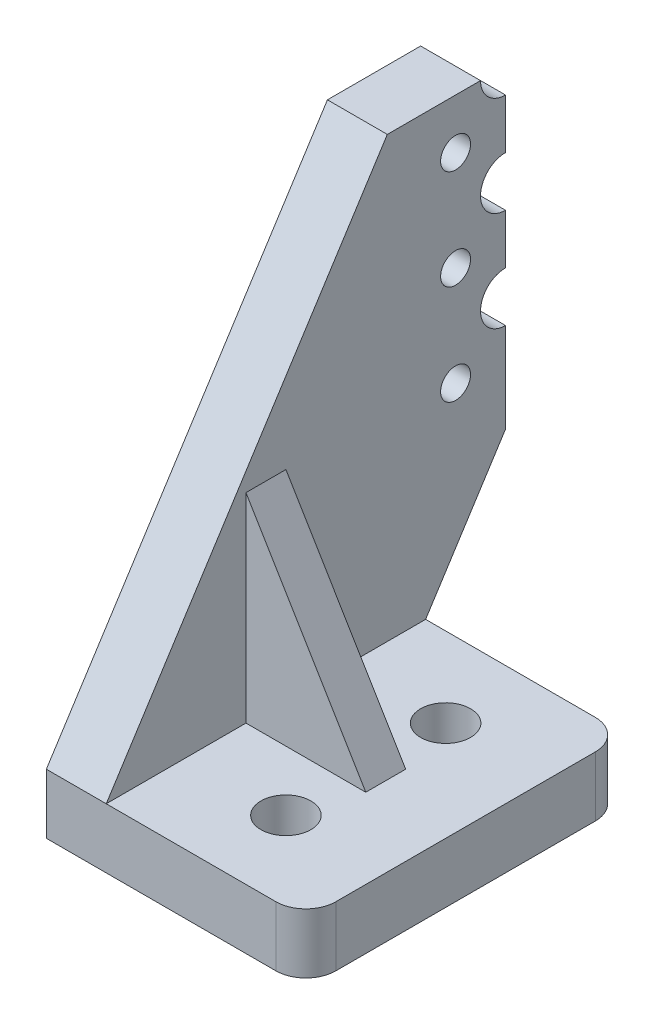
ISO-10303-21;
HEADER;
FILE_DESCRIPTION(('STEP AP214'),'2;1');
FILE_NAME('part.step','',(''),(''),'','','');
FILE_SCHEMA(('AUTOMOTIVE_DESIGN { 1 0 10303 214 1 1 1 1 }'));
ENDSEC;
DATA;
#1=APPLICATION_CONTEXT('core data for automotive mechanical design processes');
#2=APPLICATION_PROTOCOL_DEFINITION('international standard','automotive_design',2000,#1);
#3=PRODUCT_CONTEXT('',#1,'mechanical');
#4=PRODUCT('Part','Part','',(#3));
#5=PRODUCT_RELATED_PRODUCT_CATEGORY('part','',(#4));
#6=PRODUCT_DEFINITION_FORMATION('','',#4);
#7=PRODUCT_DEFINITION_CONTEXT('part definition',#1,'design');
#8=PRODUCT_DEFINITION('design','',#6,#7);
#9=PRODUCT_DEFINITION_SHAPE('','',#8);
#10=(LENGTH_UNIT() NAMED_UNIT(*) SI_UNIT(.MILLI.,.METRE.));
#11=(NAMED_UNIT(*) PLANE_ANGLE_UNIT() SI_UNIT($,.RADIAN.));
#12=(NAMED_UNIT(*) SI_UNIT($,.STERADIAN.) SOLID_ANGLE_UNIT());
#13=UNCERTAINTY_MEASURE_WITH_UNIT(LENGTH_MEASURE(1.E-05),#10,'distance_accuracy_value','');
#14=(GEOMETRIC_REPRESENTATION_CONTEXT(3) GLOBAL_UNCERTAINTY_ASSIGNED_CONTEXT((#13)) GLOBAL_UNIT_ASSIGNED_CONTEXT((#10,
#11,#12)) REPRESENTATION_CONTEXT('',''));
#15=CARTESIAN_POINT('',(0.,0.,0.));
#16=DIRECTION('',(0.,0.,1.));
#17=DIRECTION('',(1.,0.,0.));
#18=AXIS2_PLACEMENT_3D('',#15,#16,#17);
#19=CARTESIAN_POINT('',(3.,30.,0.));
#20=DIRECTION('',(-1.,0.,0.));
#21=DIRECTION('',(0.,0.,-1.));
#22=AXIS2_PLACEMENT_3D('',#19,#20,#21);
#23=PLANE('',#22);
#24=CARTESIAN_POINT('',(3.,17.5,2.5));
#25=DIRECTION('',(1.,0.,0.));
#26=DIRECTION('',(0.,0.,-1.));
#27=AXIS2_PLACEMENT_3D('',#24,#25,#26);
#28=CIRCLE('',#27,0.750000000000001);
#29=CARTESIAN_POINT('',(3.,17.5,1.75));
#30=VERTEX_POINT('',#29);
#31=EDGE_CURVE('E347',#30,#30,#28,.F.);
#32=ORIENTED_EDGE('',*,*,#31,.T.);
#33=EDGE_LOOP('',(#32));
#34=FACE_BOUND('',#33,.T.);
#35=CARTESIAN_POINT('',(3.,22.5,2.5));
#36=DIRECTION('',(1.,0.,0.));
#37=DIRECTION('',(0.,0.,-1.));
#38=AXIS2_PLACEMENT_3D('',#35,#36,#37);
#39=CIRCLE('',#38,0.750000000000001);
#40=CARTESIAN_POINT('',(3.,22.5,1.75));
#41=VERTEX_POINT('',#40);
#42=EDGE_CURVE('E341',#41,#41,#39,.F.);
#43=ORIENTED_EDGE('',*,*,#42,.T.);
#44=EDGE_LOOP('',(#43));
#45=FACE_BOUND('',#44,.T.);
#46=CARTESIAN_POINT('',(3.,12.5,2.5));
#47=DIRECTION('',(1.,0.,0.));
#48=DIRECTION('',(0.,0.,-1.));
#49=AXIS2_PLACEMENT_3D('',#46,#47,#48);
#50=CIRCLE('',#49,0.750000000000001);
#51=CARTESIAN_POINT('',(3.,12.5,1.75));
#52=VERTEX_POINT('',#51);
#53=EDGE_CURVE('E170',#52,#52,#50,.F.);
#54=ORIENTED_EDGE('',*,*,#53,.T.);
#55=EDGE_LOOP('',(#54));
#56=FACE_BOUND('',#55,.T.);
#57=CARTESIAN_POINT('',(3.,20.,0.));
#58=DIRECTION('',(1.,0.,0.));
#59=DIRECTION('',(0.,0.,-1.));
#60=AXIS2_PLACEMENT_3D('',#57,#58,#59);
#61=CIRCLE('',#60,1.25);
#62=CARTESIAN_POINT('',(3.,21.25,0.));
#63=VERTEX_POINT('',#62);
#64=CARTESIAN_POINT('',(3.,18.75,0.));
#65=VERTEX_POINT('',#64);
#66=EDGE_CURVE('E189',#63,#65,#61,.T.);
#67=ORIENTED_EDGE('',*,*,#66,.F.);
#68=DIRECTION('',(0.,1.,0.));
#69=VECTOR('',#68,1.);
#70=CARTESIAN_POINT('',(3.,0.,0.));
#71=LINE('',#70,#69);
#72=CARTESIAN_POINT('',(3.,23.75,0.));
#73=VERTEX_POINT('',#72);
#74=EDGE_CURVE('E185',#63,#73,#71,.T.);
#75=ORIENTED_EDGE('',*,*,#74,.T.);
#76=CARTESIAN_POINT('',(3.,25.,0.));
#77=DIRECTION('',(1.,0.,0.));
#78=DIRECTION('',(0.,0.,-1.));
#79=AXIS2_PLACEMENT_3D('',#76,#77,#78);
#80=CIRCLE('',#79,1.25);
#81=CARTESIAN_POINT('',(3.,25.,1.25));
#82=VERTEX_POINT('',#81);
#83=EDGE_CURVE('E163',#82,#73,#80,.T.);
#84=ORIENTED_EDGE('',*,*,#83,.F.);
#85=DIRECTION('',(0.,0.,1.));
#86=VECTOR('',#85,1.);
#87=CARTESIAN_POINT('',(3.,25.,0.));
#88=LINE('',#87,#86);
#89=CARTESIAN_POINT('',(3.,25.,5.92));
#90=VERTEX_POINT('',#89);
#91=EDGE_CURVE('E173',#82,#90,#88,.T.);
#92=ORIENTED_EDGE('',*,*,#91,.T.);
#93=DIRECTION('',(0.,-0.842271400661511,0.539053696423367));
#94=VECTOR('',#93,1.);
#95=CARTESIAN_POINT('',(3.,28.,4.));
#96=LINE('',#95,#94);
#97=CARTESIAN_POINT('',(3.,3.,20.));
#98=VERTEX_POINT('',#97);
#99=EDGE_CURVE('E213',#90,#98,#96,.T.);
#100=ORIENTED_EDGE('',*,*,#99,.T.);
#101=DIRECTION('',(0.,0.,1.));
#102=VECTOR('',#101,1.);
#103=CARTESIAN_POINT('',(3.,3.,20.));
#104=LINE('',#103,#102);
#105=CARTESIAN_POINT('',(3.,3.,13.));
#106=VERTEX_POINT('',#105);
#107=EDGE_CURVE('E278',#106,#98,#104,.T.);
#108=ORIENTED_EDGE('',*,*,#107,.F.);
#109=DIRECTION('',(0.,1.,0.));
#110=VECTOR('',#109,1.);
#111=CARTESIAN_POINT('',(3.,13.,13.));
#112=LINE('',#111,#110);
#113=CARTESIAN_POINT('',(3.,13.,13.));
#114=VERTEX_POINT('',#113);
#115=EDGE_CURVE('E308',#106,#114,#112,.T.);
#116=ORIENTED_EDGE('',*,*,#115,.T.);
#117=DIRECTION('',(0.,0.,-1.));
#118=VECTOR('',#117,1.);
#119=CARTESIAN_POINT('',(3.,13.,13.));
#120=LINE('',#119,#118);
#121=CARTESIAN_POINT('',(3.,13.,11.));
#122=VERTEX_POINT('',#121);
#123=EDGE_CURVE('E298',#114,#122,#120,.T.);
#124=ORIENTED_EDGE('',*,*,#123,.T.);
#125=DIRECTION('',(0.,1.,0.));
#126=VECTOR('',#125,1.);
#127=CARTESIAN_POINT('',(3.,13.,11.));
#128=LINE('',#127,#126);
#129=CARTESIAN_POINT('',(3.,3.,11.));
#130=VERTEX_POINT('',#129);
#131=EDGE_CURVE('E180',#130,#122,#128,.T.);
#132=ORIENTED_EDGE('',*,*,#131,.F.);
#133=CARTESIAN_POINT('',(3.,3.,4.));
#134=VERTEX_POINT('',#133);
#135=EDGE_CURVE('E276',#134,#130,#104,.T.);
#136=ORIENTED_EDGE('',*,*,#135,.F.);
#137=DIRECTION('',(0.,0.842271400661511,-0.539053696423367));
#138=VECTOR('',#137,1.);
#139=CARTESIAN_POINT('',(3.,15.5,-4.));
#140=LINE('',#139,#138);
#141=CARTESIAN_POINT('',(3.,9.25,0.));
#142=VERTEX_POINT('',#141);
#143=EDGE_CURVE('E215',#134,#142,#140,.T.);
#144=ORIENTED_EDGE('',*,*,#143,.T.);
#145=CARTESIAN_POINT('',(3.,13.75,0.));
#146=VERTEX_POINT('',#145);
#147=EDGE_CURVE('E322',#142,#146,#71,.T.);
#148=ORIENTED_EDGE('',*,*,#147,.T.);
#149=CARTESIAN_POINT('',(3.,15.,0.));
#150=DIRECTION('',(1.,0.,0.));
#151=DIRECTION('',(0.,0.,-1.));
#152=AXIS2_PLACEMENT_3D('',#149,#150,#151);
#153=CIRCLE('',#152,1.25);
#154=CARTESIAN_POINT('',(3.,16.25,0.));
#155=VERTEX_POINT('',#154);
#156=EDGE_CURVE('E200',#155,#146,#153,.T.);
#157=ORIENTED_EDGE('',*,*,#156,.F.);
#158=EDGE_CURVE('E324',#155,#65,#71,.T.);
#159=ORIENTED_EDGE('',*,*,#158,.T.);
#160=EDGE_LOOP('',(#67,#75,#84,#92,#100,#108,#116,#124,#132,#136,#144,#148,#157,#159));
#161=FACE_BOUND('',#160,.T.);
#162=ADVANCED_FACE('F30',(#34,#45,#56,#161),#23,.F.);
#163=CARTESIAN_POINT('',(11.5,3.,5.5));
#164=DIRECTION('',(0.,1.,0.));
#165=DIRECTION('',(0.,0.,1.));
#166=AXIS2_PLACEMENT_3D('',#163,#164,#165);
#167=PLANE('',#166);
#168=CARTESIAN_POINT('',(8.,3.,16.));
#169=DIRECTION('',(0.,1.,0.));
#170=DIRECTION('',(0.,0.,-1.));
#171=AXIS2_PLACEMENT_3D('',#168,#169,#170);
#172=CIRCLE('',#171,1.25);
#173=CARTESIAN_POINT('',(8.,3.,14.75));
#174=VERTEX_POINT('',#173);
#175=EDGE_CURVE('E286',#174,#174,#172,.T.);
#176=ORIENTED_EDGE('',*,*,#175,.F.);
#177=EDGE_LOOP('',(#176));
#178=FACE_BOUND('',#177,.T.);
#179=CARTESIAN_POINT('',(8.,3.,8.));
#180=DIRECTION('',(0.,1.,0.));
#181=DIRECTION('',(0.,0.,-1.));
#182=AXIS2_PLACEMENT_3D('',#179,#180,#181);
#183=CIRCLE('',#182,1.25);
#184=CARTESIAN_POINT('',(8.,3.,6.75));
#185=VERTEX_POINT('',#184);
#186=EDGE_CURVE('E292',#185,#185,#183,.T.);
#187=ORIENTED_EDGE('',*,*,#186,.F.);
#188=EDGE_LOOP('',(#187));
#189=FACE_BOUND('',#188,.T.);
#190=ORIENTED_EDGE('',*,*,#107,.T.);
#191=DIRECTION('',(1.,0.,0.));
#192=VECTOR('',#191,1.);
#193=CARTESIAN_POINT('',(3.,3.,20.));
#194=LINE('',#193,#192);
#195=CARTESIAN_POINT('',(11.5,3.,20.));
#196=VERTEX_POINT('',#195);
#197=EDGE_CURVE('E231',#98,#196,#194,.T.);
#198=ORIENTED_EDGE('',*,*,#197,.T.);
#199=CARTESIAN_POINT('',(11.5,3.,18.5));
#200=DIRECTION('',(0.,1.,0.));
#201=DIRECTION('',(0.,0.,1.));
#202=AXIS2_PLACEMENT_3D('',#199,#200,#201);
#203=CIRCLE('',#202,1.5);
#204=CARTESIAN_POINT('',(13.,3.,18.5));
#205=VERTEX_POINT('',#204);
#206=EDGE_CURVE('E270',#196,#205,#203,.T.);
#207=ORIENTED_EDGE('',*,*,#206,.T.);
#208=DIRECTION('',(0.,0.,-1.));
#209=VECTOR('',#208,1.);
#210=CARTESIAN_POINT('',(13.,3.,18.5));
#211=LINE('',#210,#209);
#212=CARTESIAN_POINT('',(13.,3.,5.5));
#213=VERTEX_POINT('',#212);
#214=EDGE_CURVE('E268',#205,#213,#211,.T.);
#215=ORIENTED_EDGE('',*,*,#214,.T.);
#216=CARTESIAN_POINT('',(11.5,3.,5.5));
#217=DIRECTION('',(0.,1.,0.));
#218=DIRECTION('',(0.,0.,1.));
#219=AXIS2_PLACEMENT_3D('',#216,#217,#218);
#220=CIRCLE('',#219,1.5);
#221=CARTESIAN_POINT('',(11.5,3.,4.));
#222=VERTEX_POINT('',#221);
#223=EDGE_CURVE('E264',#213,#222,#220,.T.);
#224=ORIENTED_EDGE('',*,*,#223,.T.);
#225=DIRECTION('',(-1.,0.,0.));
#226=VECTOR('',#225,1.);
#227=CARTESIAN_POINT('',(3.,3.,4.));
#228=LINE('',#227,#226);
#229=EDGE_CURVE('E249',#222,#134,#228,.T.);
#230=ORIENTED_EDGE('',*,*,#229,.T.);
#231=ORIENTED_EDGE('',*,*,#135,.T.);
#232=DIRECTION('',(-1.,0.,0.));
#233=VECTOR('',#232,1.);
#234=CARTESIAN_POINT('',(3.,3.,11.));
#235=LINE('',#234,#233);
#236=CARTESIAN_POINT('',(9.,3.,11.));
#237=VERTEX_POINT('',#236);
#238=EDGE_CURVE('E311',#237,#130,#235,.T.);
#239=ORIENTED_EDGE('',*,*,#238,.F.);
#240=DIRECTION('',(0.,0.,-1.));
#241=VECTOR('',#240,1.);
#242=CARTESIAN_POINT('',(9.,3.,13.));
#243=LINE('',#242,#241);
#244=CARTESIAN_POINT('',(9.,3.,13.));
#245=VERTEX_POINT('',#244);
#246=EDGE_CURVE('E301',#245,#237,#243,.T.);
#247=ORIENTED_EDGE('',*,*,#246,.F.);
#248=DIRECTION('',(-1.,0.,0.));
#249=VECTOR('',#248,1.);
#250=CARTESIAN_POINT('',(3.,3.,13.));
#251=LINE('',#250,#249);
#252=EDGE_CURVE('E304',#245,#106,#251,.T.);
#253=ORIENTED_EDGE('',*,*,#252,.T.);
#254=EDGE_LOOP('',(#190,#198,#207,#215,#224,#230,#231,#239,#247,#253));
#255=FACE_BOUND('',#254,.T.);
#256=ADVANCED_FACE('F365',(#178,#189,#255),#167,.T.);
#257=CARTESIAN_POINT('',(3.,15.5,-4.));
#258=DIRECTION('',(0.,-0.539053696423367,-0.842271400661511));
#259=DIRECTION('',(0.,0.842271400661512,-0.539053696423367));
#260=AXIS2_PLACEMENT_3D('',#257,#258,#259);
#261=PLANE('',#260);
#262=DIRECTION('',(-1.,0.,0.));
#263=VECTOR('',#262,1.);
#264=CARTESIAN_POINT('',(13.001,9.25,0.));
#265=LINE('',#264,#263);
#266=CARTESIAN_POINT('',(0.,9.25,0.));
#267=VERTEX_POINT('',#266);
#268=EDGE_CURVE('E325',#142,#267,#265,.T.);
#269=ORIENTED_EDGE('',*,*,#268,.F.);
#270=ORIENTED_EDGE('',*,*,#143,.F.);
#271=DIRECTION('',(-1.,0.,0.));
#272=VECTOR('',#271,1.);
#273=CARTESIAN_POINT('',(3.,3.,4.));
#274=LINE('',#273,#272);
#275=CARTESIAN_POINT('',(0.,3.,4.));
#276=VERTEX_POINT('',#275);
#277=EDGE_CURVE('E11',#134,#276,#274,.T.);
#278=ORIENTED_EDGE('',*,*,#277,.T.);
#279=DIRECTION('',(0.,0.842271400661511,-0.539053696423367));
#280=VECTOR('',#279,1.);
#281=CARTESIAN_POINT('',(0.,15.5,-4.));
#282=LINE('',#281,#280);
#283=EDGE_CURVE('E210',#276,#267,#282,.T.);
#284=ORIENTED_EDGE('',*,*,#283,.T.);
#285=EDGE_LOOP('',(#269,#270,#278,#284));
#286=FACE_BOUND('',#285,.T.);
#287=ADVANCED_FACE('F412',(#286),#261,.T.);
#288=CARTESIAN_POINT('',(3.,3.,4.));
#289=DIRECTION('',(0.,0.,-1.));
#290=DIRECTION('',(1.,0.,0.));
#291=AXIS2_PLACEMENT_3D('',#288,#289,#290);
#292=PLANE('',#291);
#293=DIRECTION('',(0.,1.,0.));
#294=VECTOR('',#293,1.);
#295=CARTESIAN_POINT('',(0.,3.,4.));
#296=LINE('',#295,#294);
#297=CARTESIAN_POINT('',(0.,0.,4.));
#298=VERTEX_POINT('',#297);
#299=EDGE_CURVE('E208',#298,#276,#296,.T.);
#300=ORIENTED_EDGE('',*,*,#299,.T.);
#301=ORIENTED_EDGE('',*,*,#277,.F.);
#302=ORIENTED_EDGE('',*,*,#229,.F.);
#303=DIRECTION('',(0.,-1.,0.));
#304=VECTOR('',#303,1.);
#305=CARTESIAN_POINT('',(11.5,3.,4.));
#306=LINE('',#305,#304);
#307=CARTESIAN_POINT('',(11.5,0.,4.));
#308=VERTEX_POINT('',#307);
#309=EDGE_CURVE('E191',#222,#308,#306,.T.);
#310=ORIENTED_EDGE('',*,*,#309,.T.);
#311=DIRECTION('',(-1.,0.,0.));
#312=VECTOR('',#311,1.);
#313=CARTESIAN_POINT('',(3.,0.,4.));
#314=LINE('',#313,#312);
#315=EDGE_CURVE('E39',#308,#298,#314,.T.);
#316=ORIENTED_EDGE('',*,*,#315,.T.);
#317=EDGE_LOOP('',(#300,#301,#302,#310,#316));
#318=FACE_BOUND('',#317,.T.);
#319=ADVANCED_FACE('F246',(#318),#292,.T.);
#320=CARTESIAN_POINT('',(3.,0.,4.));
#321=DIRECTION('',(0.,-1.,0.));
#322=DIRECTION('',(0.,0.,-1.));
#323=AXIS2_PLACEMENT_3D('',#320,#321,#322);
#324=PLANE('',#323);
#325=DIRECTION('',(0.,0.,-1.));
#326=VECTOR('',#325,1.);
#327=CARTESIAN_POINT('',(0.,0.,4.));
#328=LINE('',#327,#326);
#329=CARTESIAN_POINT('',(0.,0.,20.));
#330=VERTEX_POINT('',#329);
#331=EDGE_CURVE('E206',#330,#298,#328,.T.);
#332=ORIENTED_EDGE('',*,*,#331,.T.);
#333=ORIENTED_EDGE('',*,*,#315,.F.);
#334=CARTESIAN_POINT('',(11.5,0.,5.5));
#335=DIRECTION('',(0.,1.,0.));
#336=DIRECTION('',(0.,0.,1.));
#337=AXIS2_PLACEMENT_3D('',#334,#335,#336);
#338=CIRCLE('',#337,1.5);
#339=CARTESIAN_POINT('',(13.,0.,5.5));
#340=VERTEX_POINT('',#339);
#341=EDGE_CURVE('E279',#340,#308,#338,.T.);
#342=ORIENTED_EDGE('',*,*,#341,.F.);
#343=DIRECTION('',(0.,0.,-1.));
#344=VECTOR('',#343,1.);
#345=CARTESIAN_POINT('',(13.,0.,18.5));
#346=LINE('',#345,#344);
#347=CARTESIAN_POINT('',(13.,0.,18.5));
#348=VERTEX_POINT('',#347);
#349=EDGE_CURVE('E281',#348,#340,#346,.T.);
#350=ORIENTED_EDGE('',*,*,#349,.F.);
#351=CARTESIAN_POINT('',(11.5,0.,18.5));
#352=DIRECTION('',(0.,1.,0.));
#353=DIRECTION('',(0.,0.,1.));
#354=AXIS2_PLACEMENT_3D('',#351,#352,#353);
#355=CIRCLE('',#354,1.5);
#356=CARTESIAN_POINT('',(11.5,0.,20.));
#357=VERTEX_POINT('',#356);
#358=EDGE_CURVE('E284',#357,#348,#355,.T.);
#359=ORIENTED_EDGE('',*,*,#358,.F.);
#360=DIRECTION('',(-1.,0.,0.));
#361=VECTOR('',#360,1.);
#362=CARTESIAN_POINT('',(3.,0.,20.));
#363=LINE('',#362,#361);
#364=EDGE_CURVE('E219',#357,#330,#363,.T.);
#365=ORIENTED_EDGE('',*,*,#364,.T.);
#366=EDGE_LOOP('',(#332,#333,#342,#350,#359,#365));
#367=FACE_BOUND('',#366,.T.);
#368=CARTESIAN_POINT('',(8.,0.,8.));
#369=DIRECTION('',(0.,1.,0.));
#370=DIRECTION('',(0.,0.,-1.));
#371=AXIS2_PLACEMENT_3D('',#368,#369,#370);
#372=CIRCLE('',#371,1.25);
#373=CARTESIAN_POINT('',(8.,0.,6.75));
#374=VERTEX_POINT('',#373);
#375=EDGE_CURVE('E295',#374,#374,#372,.T.);
#376=ORIENTED_EDGE('',*,*,#375,.T.);
#377=EDGE_LOOP('',(#376));
#378=FACE_BOUND('',#377,.T.);
#379=CARTESIAN_POINT('',(8.,0.,16.));
#380=DIRECTION('',(0.,1.,0.));
#381=DIRECTION('',(0.,0.,-1.));
#382=AXIS2_PLACEMENT_3D('',#379,#380,#381);
#383=CIRCLE('',#382,1.25);
#384=CARTESIAN_POINT('',(8.,0.,14.75));
#385=VERTEX_POINT('',#384);
#386=EDGE_CURVE('E289',#385,#385,#383,.T.);
#387=ORIENTED_EDGE('',*,*,#386,.T.);
#388=EDGE_LOOP('',(#387));
#389=FACE_BOUND('',#388,.T.);
#390=ADVANCED_FACE('F241',(#367,#378,#389),#324,.T.);
#391=CARTESIAN_POINT('',(3.,3.,20.));
#392=DIRECTION('',(0.,0.,1.));
#393=DIRECTION('',(-1.,0.,0.));
#394=AXIS2_PLACEMENT_3D('',#391,#392,#393);
#395=PLANE('',#394);
#396=DIRECTION('',(0.,-1.,0.));
#397=VECTOR('',#396,1.);
#398=CARTESIAN_POINT('',(0.,3.,20.));
#399=LINE('',#398,#397);
#400=CARTESIAN_POINT('',(0.,3.,20.));
#401=VERTEX_POINT('',#400);
#402=EDGE_CURVE('E204',#401,#330,#399,.T.);
#403=ORIENTED_EDGE('',*,*,#402,.T.);
#404=ORIENTED_EDGE('',*,*,#364,.F.);
#405=DIRECTION('',(0.,-1.,0.));
#406=VECTOR('',#405,1.);
#407=CARTESIAN_POINT('',(11.5,3.,20.));
#408=LINE('',#407,#406);
#409=EDGE_CURVE('E260',#196,#357,#408,.T.);
#410=ORIENTED_EDGE('',*,*,#409,.F.);
#411=ORIENTED_EDGE('',*,*,#197,.F.);
#412=DIRECTION('',(-1.,0.,0.));
#413=VECTOR('',#412,1.);
#414=CARTESIAN_POINT('',(3.,3.,20.));
#415=LINE('',#414,#413);
#416=EDGE_CURVE('E34',#98,#401,#415,.T.);
#417=ORIENTED_EDGE('',*,*,#416,.T.);
#418=EDGE_LOOP('',(#403,#404,#410,#411,#417));
#419=FACE_BOUND('',#418,.T.);
#420=ADVANCED_FACE('F229',(#419),#395,.T.);
#421=CARTESIAN_POINT('',(3.,28.,4.));
#422=DIRECTION('',(0.,0.539053696423367,0.842271400661511));
#423=DIRECTION('',(0.,-0.842271400661512,0.539053696423367));
#424=AXIS2_PLACEMENT_3D('',#421,#422,#423);
#425=PLANE('',#424);
#426=DIRECTION('',(1.,0.,0.));
#427=VECTOR('',#426,1.);
#428=CARTESIAN_POINT('',(13.001,25.,5.92));
#429=LINE('',#428,#427);
#430=CARTESIAN_POINT('',(0.,25.,5.92));
#431=VERTEX_POINT('',#430);
#432=EDGE_CURVE('E176',#431,#90,#429,.T.);
#433=ORIENTED_EDGE('',*,*,#432,.F.);
#434=DIRECTION('',(0.,-0.842271400661511,0.539053696423367));
#435=VECTOR('',#434,1.);
#436=CARTESIAN_POINT('',(0.,28.,4.));
#437=LINE('',#436,#435);
#438=EDGE_CURVE('E202',#431,#401,#437,.T.);
#439=ORIENTED_EDGE('',*,*,#438,.T.);
#440=ORIENTED_EDGE('',*,*,#416,.F.);
#441=ORIENTED_EDGE('',*,*,#99,.F.);
#442=EDGE_LOOP('',(#433,#439,#440,#441));
#443=FACE_BOUND('',#442,.T.);
#444=ADVANCED_FACE('F32',(#443),#425,.T.);
#445=CARTESIAN_POINT('',(0.,30.,0.));
#446=DIRECTION('',(-1.,0.,0.));
#447=DIRECTION('',(0.,0.,-1.));
#448=AXIS2_PLACEMENT_3D('',#445,#446,#447);
#449=PLANE('',#448);
#450=CARTESIAN_POINT('',(0.,17.5,2.5));
#451=DIRECTION('',(1.,0.,0.));
#452=DIRECTION('',(0.,0.,-1.));
#453=AXIS2_PLACEMENT_3D('',#450,#451,#452);
#454=CIRCLE('',#453,0.750000000000001);
#455=CARTESIAN_POINT('',(0.,17.5,1.75));
#456=VERTEX_POINT('',#455);
#457=EDGE_CURVE('E350',#456,#456,#454,.T.);
#458=ORIENTED_EDGE('',*,*,#457,.T.);
#459=EDGE_LOOP('',(#458));
#460=FACE_BOUND('',#459,.T.);
#461=CARTESIAN_POINT('',(0.,22.5,2.5));
#462=DIRECTION('',(1.,0.,0.));
#463=DIRECTION('',(0.,0.,-1.));
#464=AXIS2_PLACEMENT_3D('',#461,#462,#463);
#465=CIRCLE('',#464,0.750000000000001);
#466=CARTESIAN_POINT('',(0.,22.5,1.75));
#467=VERTEX_POINT('',#466);
#468=EDGE_CURVE('E344',#467,#467,#465,.T.);
#469=ORIENTED_EDGE('',*,*,#468,.T.);
#470=EDGE_LOOP('',(#469));
#471=FACE_BOUND('',#470,.T.);
#472=CARTESIAN_POINT('',(0.,12.5,2.5));
#473=DIRECTION('',(1.,0.,0.));
#474=DIRECTION('',(0.,0.,-1.));
#475=AXIS2_PLACEMENT_3D('',#472,#473,#474);
#476=CIRCLE('',#475,0.750000000000001);
#477=CARTESIAN_POINT('',(0.,12.5,1.75));
#478=VERTEX_POINT('',#477);
#479=EDGE_CURVE('E338',#478,#478,#476,.T.);
#480=ORIENTED_EDGE('',*,*,#479,.T.);
#481=EDGE_LOOP('',(#480));
#482=FACE_BOUND('',#481,.T.);
#483=DIRECTION('',(0.,-1.,0.));
#484=VECTOR('',#483,1.);
#485=CARTESIAN_POINT('',(0.,0.,0.));
#486=LINE('',#485,#484);
#487=CARTESIAN_POINT('',(0.,18.75,0.));
#488=VERTEX_POINT('',#487);
#489=CARTESIAN_POINT('',(0.,16.25,0.));
#490=VERTEX_POINT('',#489);
#491=EDGE_CURVE('E319',#488,#490,#486,.T.);
#492=ORIENTED_EDGE('',*,*,#491,.T.);
#493=CARTESIAN_POINT('',(0.,15.,0.));
#494=DIRECTION('',(1.,0.,0.));
#495=DIRECTION('',(0.,0.,-1.));
#496=AXIS2_PLACEMENT_3D('',#493,#494,#495);
#497=CIRCLE('',#496,1.25);
#498=CARTESIAN_POINT('',(0.,13.75,0.));
#499=VERTEX_POINT('',#498);
#500=EDGE_CURVE('E197',#490,#499,#497,.T.);
#501=ORIENTED_EDGE('',*,*,#500,.T.);
#502=EDGE_CURVE('E317',#499,#267,#486,.T.);
#503=ORIENTED_EDGE('',*,*,#502,.T.);
#504=ORIENTED_EDGE('',*,*,#283,.F.);
#505=ORIENTED_EDGE('',*,*,#299,.F.);
#506=ORIENTED_EDGE('',*,*,#331,.F.);
#507=ORIENTED_EDGE('',*,*,#402,.F.);
#508=ORIENTED_EDGE('',*,*,#438,.F.);
#509=DIRECTION('',(0.,0.,-1.));
#510=VECTOR('',#509,1.);
#511=CARTESIAN_POINT('',(0.,25.,0.));
#512=LINE('',#511,#510);
#513=CARTESIAN_POINT('',(0.,25.,1.25));
#514=VERTEX_POINT('',#513);
#515=EDGE_CURVE('E320',#431,#514,#512,.T.);
#516=ORIENTED_EDGE('',*,*,#515,.T.);
#517=CARTESIAN_POINT('',(0.,25.,0.));
#518=DIRECTION('',(1.,0.,0.));
#519=DIRECTION('',(0.,0.,-1.));
#520=AXIS2_PLACEMENT_3D('',#517,#518,#519);
#521=CIRCLE('',#520,1.25);
#522=CARTESIAN_POINT('',(0.,23.75,0.));
#523=VERTEX_POINT('',#522);
#524=EDGE_CURVE('E166',#514,#523,#521,.T.);
#525=ORIENTED_EDGE('',*,*,#524,.T.);
#526=CARTESIAN_POINT('',(0.,21.25,0.));
#527=VERTEX_POINT('',#526);
#528=EDGE_CURVE('E181',#523,#527,#486,.T.);
#529=ORIENTED_EDGE('',*,*,#528,.T.);
#530=CARTESIAN_POINT('',(0.,20.,0.));
#531=DIRECTION('',(1.,0.,0.));
#532=DIRECTION('',(0.,0.,-1.));
#533=AXIS2_PLACEMENT_3D('',#530,#531,#532);
#534=CIRCLE('',#533,1.25);
#535=EDGE_CURVE('E186',#527,#488,#534,.T.);
#536=ORIENTED_EDGE('',*,*,#535,.T.);
#537=EDGE_LOOP('',(#492,#501,#503,#504,#505,#506,#507,#508,#516,#525,#529,#536));
#538=FACE_BOUND('',#537,.T.);
#539=ADVANCED_FACE('F237',(#460,#471,#482,#538),#449,.T.);
#540=CARTESIAN_POINT('',(3.,15.,0.));
#541=DIRECTION('',(-1.,0.,0.));
#542=DIRECTION('',(0.,0.,-1.));
#543=AXIS2_PLACEMENT_3D('',#540,#541,#542);
#544=CYLINDRICAL_SURFACE('',#543,1.25);
#545=ORIENTED_EDGE('',*,*,#156,.T.);
#546=DIRECTION('',(-1.,0.,0.));
#547=VECTOR('',#546,1.);
#548=CARTESIAN_POINT('',(3.,13.75,0.));
#549=LINE('',#548,#547);
#550=EDGE_CURVE('E47',#146,#499,#549,.T.);
#551=ORIENTED_EDGE('',*,*,#550,.T.);
#552=ORIENTED_EDGE('',*,*,#500,.F.);
#553=DIRECTION('',(-1.,0.,0.));
#554=VECTOR('',#553,1.);
#555=CARTESIAN_POINT('',(3.,16.25,0.));
#556=LINE('',#555,#554);
#557=EDGE_CURVE('E330',#490,#155,#556,.F.);
#558=ORIENTED_EDGE('',*,*,#557,.T.);
#559=EDGE_LOOP('',(#545,#551,#552,#558));
#560=FACE_BOUND('',#559,.T.);
#561=ADVANCED_FACE('F428',(#560),#544,.F.);
#562=CARTESIAN_POINT('',(3.,20.,0.));
#563=DIRECTION('',(-1.,0.,0.));
#564=DIRECTION('',(0.,0.,-1.));
#565=AXIS2_PLACEMENT_3D('',#562,#563,#564);
#566=CYLINDRICAL_SURFACE('',#565,1.25);
#567=ORIENTED_EDGE('',*,*,#535,.F.);
#568=DIRECTION('',(-1.,0.,0.));
#569=VECTOR('',#568,1.);
#570=CARTESIAN_POINT('',(3.,21.25,0.));
#571=LINE('',#570,#569);
#572=EDGE_CURVE('E333',#527,#63,#571,.F.);
#573=ORIENTED_EDGE('',*,*,#572,.T.);
#574=ORIENTED_EDGE('',*,*,#66,.T.);
#575=DIRECTION('',(-1.,0.,0.));
#576=VECTOR('',#575,1.);
#577=CARTESIAN_POINT('',(3.,18.75,0.));
#578=LINE('',#577,#576);
#579=EDGE_CURVE('E55',#65,#488,#578,.T.);
#580=ORIENTED_EDGE('',*,*,#579,.T.);
#581=EDGE_LOOP('',(#567,#573,#574,#580));
#582=FACE_BOUND('',#581,.T.);
#583=ADVANCED_FACE('F425',(#582),#566,.F.);
#584=CARTESIAN_POINT('',(3.,25.,0.));
#585=DIRECTION('',(-1.,0.,0.));
#586=DIRECTION('',(0.,0.,-1.));
#587=AXIS2_PLACEMENT_3D('',#584,#585,#586);
#588=CYLINDRICAL_SURFACE('',#587,1.25);
#589=ORIENTED_EDGE('',*,*,#524,.F.);
#590=DIRECTION('',(-1.,0.,0.));
#591=VECTOR('',#590,1.);
#592=CARTESIAN_POINT('',(3.,25.,1.25));
#593=LINE('',#592,#591);
#594=EDGE_CURVE('E159',#514,#82,#593,.F.);
#595=ORIENTED_EDGE('',*,*,#594,.T.);
#596=ORIENTED_EDGE('',*,*,#83,.T.);
#597=DIRECTION('',(-1.,0.,0.));
#598=VECTOR('',#597,1.);
#599=CARTESIAN_POINT('',(3.,23.75,0.));
#600=LINE('',#599,#598);
#601=EDGE_CURVE('E169',#73,#523,#600,.T.);
#602=ORIENTED_EDGE('',*,*,#601,.T.);
#603=EDGE_LOOP('',(#589,#595,#596,#602));
#604=FACE_BOUND('',#603,.T.);
#605=ADVANCED_FACE('F161',(#604),#588,.F.);
#606=CARTESIAN_POINT('',(11.5,3.,5.5));
#607=DIRECTION('',(0.,-1.,0.));
#608=DIRECTION('',(0.,0.,-1.));
#609=AXIS2_PLACEMENT_3D('',#606,#607,#608);
#610=CYLINDRICAL_SURFACE('',#609,1.5);
#611=ORIENTED_EDGE('',*,*,#341,.T.);
#612=ORIENTED_EDGE('',*,*,#309,.F.);
#613=ORIENTED_EDGE('',*,*,#223,.F.);
#614=DIRECTION('',(0.,-1.,0.));
#615=VECTOR('',#614,1.);
#616=CARTESIAN_POINT('',(13.,3.,5.5));
#617=LINE('',#616,#615);
#618=EDGE_CURVE('E253',#213,#340,#617,.T.);
#619=ORIENTED_EDGE('',*,*,#618,.T.);
#620=EDGE_LOOP('',(#611,#612,#613,#619));
#621=FACE_BOUND('',#620,.T.);
#622=ADVANCED_FACE('F414',(#621),#610,.T.);
#623=CARTESIAN_POINT('',(13.,3.,18.5));
#624=DIRECTION('',(1.,0.,0.));
#625=DIRECTION('',(0.,0.,1.));
#626=AXIS2_PLACEMENT_3D('',#623,#624,#625);
#627=PLANE('',#626);
#628=ORIENTED_EDGE('',*,*,#349,.T.);
#629=ORIENTED_EDGE('',*,*,#618,.F.);
#630=ORIENTED_EDGE('',*,*,#214,.F.);
#631=DIRECTION('',(0.,-1.,0.));
#632=VECTOR('',#631,1.);
#633=CARTESIAN_POINT('',(13.,3.,18.5));
#634=LINE('',#633,#632);
#635=EDGE_CURVE('E255',#205,#348,#634,.T.);
#636=ORIENTED_EDGE('',*,*,#635,.T.);
#637=EDGE_LOOP('',(#628,#629,#630,#636));
#638=FACE_BOUND('',#637,.T.);
#639=ADVANCED_FACE('F417',(#638),#627,.T.);
#640=CARTESIAN_POINT('',(11.5,3.,18.5));
#641=DIRECTION('',(0.,-1.,0.));
#642=DIRECTION('',(0.,0.,-1.));
#643=AXIS2_PLACEMENT_3D('',#640,#641,#642);
#644=CYLINDRICAL_SURFACE('',#643,1.5);
#645=ORIENTED_EDGE('',*,*,#358,.T.);
#646=ORIENTED_EDGE('',*,*,#635,.F.);
#647=ORIENTED_EDGE('',*,*,#206,.F.);
#648=ORIENTED_EDGE('',*,*,#409,.T.);
#649=EDGE_LOOP('',(#645,#646,#647,#648));
#650=FACE_BOUND('',#649,.T.);
#651=ADVANCED_FACE('F408',(#650),#644,.T.);
#652=CARTESIAN_POINT('',(8.,3.,16.));
#653=DIRECTION('',(0.,-1.,0.));
#654=DIRECTION('',(0.,0.,-1.));
#655=AXIS2_PLACEMENT_3D('',#652,#653,#654);
#656=CYLINDRICAL_SURFACE('',#655,1.25);
#657=ORIENTED_EDGE('',*,*,#175,.T.);
#658=EDGE_LOOP('',(#657));
#659=FACE_BOUND('',#658,.T.);
#660=ORIENTED_EDGE('',*,*,#386,.F.);
#661=EDGE_LOOP('',(#660));
#662=FACE_BOUND('',#661,.T.);
#663=ADVANCED_FACE('F404',(#659,#662),#656,.F.);
#664=CARTESIAN_POINT('',(8.,3.,8.));
#665=DIRECTION('',(0.,-1.,0.));
#666=DIRECTION('',(0.,0.,-1.));
#667=AXIS2_PLACEMENT_3D('',#664,#665,#666);
#668=CYLINDRICAL_SURFACE('',#667,1.25);
#669=ORIENTED_EDGE('',*,*,#186,.T.);
#670=EDGE_LOOP('',(#669));
#671=FACE_BOUND('',#670,.T.);
#672=ORIENTED_EDGE('',*,*,#375,.F.);
#673=EDGE_LOOP('',(#672));
#674=FACE_BOUND('',#673,.T.);
#675=ADVANCED_FACE('F400',(#671,#674),#668,.F.);
#676=CARTESIAN_POINT('',(9.,3.,13.));
#677=DIRECTION('',(-0.857492925712544,-0.514495755427526,0.));
#678=DIRECTION('',(-0.514495755427526,0.857492925712544,0.));
#679=AXIS2_PLACEMENT_3D('',#676,#677,#678);
#680=PLANE('',#679);
#681=DIRECTION('',(0.514495755427526,-0.857492925712544,0.));
#682=VECTOR('',#681,1.);
#683=CARTESIAN_POINT('',(9.,3.,11.));
#684=LINE('',#683,#682);
#685=EDGE_CURVE('E313',#122,#237,#684,.T.);
#686=ORIENTED_EDGE('',*,*,#685,.F.);
#687=ORIENTED_EDGE('',*,*,#123,.F.);
#688=DIRECTION('',(0.514495755427526,-0.857492925712544,0.));
#689=VECTOR('',#688,1.);
#690=CARTESIAN_POINT('',(9.,3.,13.));
#691=LINE('',#690,#689);
#692=EDGE_CURVE('E306',#114,#245,#691,.T.);
#693=ORIENTED_EDGE('',*,*,#692,.T.);
#694=ORIENTED_EDGE('',*,*,#246,.T.);
#695=EDGE_LOOP('',(#686,#687,#693,#694));
#696=FACE_BOUND('',#695,.T.);
#697=ADVANCED_FACE('F396',(#696),#680,.F.);
#698=CARTESIAN_POINT('',(3.,3.,13.));
#699=DIRECTION('',(0.,0.,-1.));
#700=DIRECTION('',(1.,0.,0.));
#701=AXIS2_PLACEMENT_3D('',#698,#699,#700);
#702=PLANE('',#701);
#703=ORIENTED_EDGE('',*,*,#115,.F.);
#704=ORIENTED_EDGE('',*,*,#252,.F.);
#705=ORIENTED_EDGE('',*,*,#692,.F.);
#706=EDGE_LOOP('',(#703,#704,#705));
#707=FACE_BOUND('',#706,.T.);
#708=ADVANCED_FACE('F392',(#707),#702,.F.);
#709=CARTESIAN_POINT('',(3.,3.,11.));
#710=DIRECTION('',(0.,0.,-1.));
#711=DIRECTION('',(1.,0.,0.));
#712=AXIS2_PLACEMENT_3D('',#709,#710,#711);
#713=PLANE('',#712);
#714=ORIENTED_EDGE('',*,*,#131,.T.);
#715=ORIENTED_EDGE('',*,*,#685,.T.);
#716=ORIENTED_EDGE('',*,*,#238,.T.);
#717=EDGE_LOOP('',(#714,#715,#716));
#718=FACE_BOUND('',#717,.T.);
#719=ADVANCED_FACE('F389',(#718),#713,.T.);
#720=CARTESIAN_POINT('',(13.001,25.,0.));
#721=DIRECTION('',(0.,-1.,0.));
#722=DIRECTION('',(0.,0.,-1.));
#723=AXIS2_PLACEMENT_3D('',#720,#721,#722);
#724=PLANE('',#723);
#725=ORIENTED_EDGE('',*,*,#515,.F.);
#726=ORIENTED_EDGE('',*,*,#432,.T.);
#727=ORIENTED_EDGE('',*,*,#91,.F.);
#728=ORIENTED_EDGE('',*,*,#594,.F.);
#729=EDGE_LOOP('',(#725,#726,#727,#728));
#730=FACE_BOUND('',#729,.T.);
#731=ADVANCED_FACE('F174',(#730),#724,.F.);
#732=CARTESIAN_POINT('',(13.001,0.,0.));
#733=DIRECTION('',(0.,0.,1.));
#734=DIRECTION('',(-1.,0.,0.));
#735=AXIS2_PLACEMENT_3D('',#732,#733,#734);
#736=PLANE('',#735);
#737=ORIENTED_EDGE('',*,*,#572,.F.);
#738=ORIENTED_EDGE('',*,*,#528,.F.);
#739=ORIENTED_EDGE('',*,*,#601,.F.);
#740=ORIENTED_EDGE('',*,*,#74,.F.);
#741=EDGE_LOOP('',(#737,#738,#739,#740));
#742=FACE_BOUND('',#741,.T.);
#743=ADVANCED_FACE('F384',(#742),#736,.F.);
#744=ORIENTED_EDGE('',*,*,#557,.F.);
#745=ORIENTED_EDGE('',*,*,#491,.F.);
#746=ORIENTED_EDGE('',*,*,#579,.F.);
#747=ORIENTED_EDGE('',*,*,#158,.F.);
#748=EDGE_LOOP('',(#744,#745,#746,#747));
#749=FACE_BOUND('',#748,.T.);
#750=ADVANCED_FACE('F382',(#749),#736,.F.);
#751=ORIENTED_EDGE('',*,*,#147,.F.);
#752=ORIENTED_EDGE('',*,*,#268,.T.);
#753=ORIENTED_EDGE('',*,*,#502,.F.);
#754=ORIENTED_EDGE('',*,*,#550,.F.);
#755=EDGE_LOOP('',(#751,#752,#753,#754));
#756=FACE_BOUND('',#755,.T.);
#757=ADVANCED_FACE('F373',(#756),#736,.F.);
#758=CARTESIAN_POINT('',(13.001,12.5,2.5));
#759=DIRECTION('',(-1.,0.,0.));
#760=DIRECTION('',(0.,0.,-1.));
#761=AXIS2_PLACEMENT_3D('',#758,#759,#760);
#762=CYLINDRICAL_SURFACE('',#761,0.750000000000001);
#763=CARTESIAN_POINT('',(0.,12.5,1.75));
#764=CARTESIAN_POINT('',(0.03125,12.5,1.75));
#765=CARTESIAN_POINT('',(0.0625000000000001,12.5,1.75));
#766=CARTESIAN_POINT('',(0.125,12.5,1.75));
#767=CARTESIAN_POINT('',(0.15625,12.5,1.75));
#768=CARTESIAN_POINT('',(0.21875,12.5,1.75));
#769=CARTESIAN_POINT('',(0.25,12.5,1.75));
#770=CARTESIAN_POINT('',(0.3125,12.5,1.75));
#771=CARTESIAN_POINT('',(0.34375,12.5,1.75));
#772=CARTESIAN_POINT('',(0.40625,12.5,1.75));
#773=CARTESIAN_POINT('',(0.4375,12.5,1.75));
#774=CARTESIAN_POINT('',(0.5,12.5,1.75));
#775=CARTESIAN_POINT('',(0.53125,12.5,1.75));
#776=CARTESIAN_POINT('',(0.593750000000001,12.5,1.75));
#777=CARTESIAN_POINT('',(0.625000000000001,12.5,1.75));
#778=CARTESIAN_POINT('',(0.687500000000001,12.5,1.75));
#779=CARTESIAN_POINT('',(0.718750000000001,12.5,1.75));
#780=CARTESIAN_POINT('',(0.78125,12.5,1.75));
#781=CARTESIAN_POINT('',(0.8125,12.5,1.75));
#782=CARTESIAN_POINT('',(0.874999999999999,12.5,1.75));
#783=CARTESIAN_POINT('',(0.906249999999999,12.5,1.75));
#784=CARTESIAN_POINT('',(0.968749999999999,12.5,1.75));
#785=CARTESIAN_POINT('',(0.999999999999999,12.5,1.75));
#786=CARTESIAN_POINT('',(1.0625,12.5,1.75));
#787=CARTESIAN_POINT('',(1.09375,12.5,1.75));
#788=CARTESIAN_POINT('',(1.15625,12.5,1.75));
#789=CARTESIAN_POINT('',(1.1875,12.5,1.75));
#790=CARTESIAN_POINT('',(1.25,12.5,1.75));
#791=CARTESIAN_POINT('',(1.28125,12.5,1.75));
#792=CARTESIAN_POINT('',(1.34375,12.5,1.75));
#793=CARTESIAN_POINT('',(1.375,12.5,1.75));
#794=CARTESIAN_POINT('',(1.4375,12.5,1.75));
#795=CARTESIAN_POINT('',(1.46875,12.5,1.75));
#796=CARTESIAN_POINT('',(1.53125,12.5,1.75));
#797=CARTESIAN_POINT('',(1.5625,12.5,1.75));
#798=CARTESIAN_POINT('',(1.625,12.5,1.75));
#799=CARTESIAN_POINT('',(1.65625,12.5,1.75));
#800=CARTESIAN_POINT('',(1.71875,12.5,1.75));
#801=CARTESIAN_POINT('',(1.75,12.5,1.75));
#802=CARTESIAN_POINT('',(1.8125,12.5,1.75));
#803=CARTESIAN_POINT('',(1.84375,12.5,1.75));
#804=CARTESIAN_POINT('',(1.90625,12.5,1.75));
#805=CARTESIAN_POINT('',(1.9375,12.5,1.75));
#806=CARTESIAN_POINT('',(2.,12.5,1.75));
#807=CARTESIAN_POINT('',(2.03125,12.5,1.75));
#808=CARTESIAN_POINT('',(2.09375,12.5,1.75));
#809=CARTESIAN_POINT('',(2.125,12.5,1.75));
#810=CARTESIAN_POINT('',(2.1875,12.5,1.75));
#811=CARTESIAN_POINT('',(2.21875,12.5,1.75));
#812=CARTESIAN_POINT('',(2.28125,12.5,1.75));
#813=CARTESIAN_POINT('',(2.3125,12.5,1.75));
#814=CARTESIAN_POINT('',(2.375,12.5,1.75));
#815=CARTESIAN_POINT('',(2.40625,12.5,1.75));
#816=CARTESIAN_POINT('',(2.46875,12.5,1.75));
#817=CARTESIAN_POINT('',(2.5,12.5,1.75));
#818=CARTESIAN_POINT('',(2.5625,12.5,1.75));
#819=CARTESIAN_POINT('',(2.59375,12.5,1.75));
#820=CARTESIAN_POINT('',(2.65625,12.5,1.75));
#821=CARTESIAN_POINT('',(2.6875,12.5,1.75));
#822=CARTESIAN_POINT('',(2.75,12.5,1.75));
#823=CARTESIAN_POINT('',(2.78125,12.5,1.75));
#824=CARTESIAN_POINT('',(2.84375,12.5,1.75));
#825=CARTESIAN_POINT('',(2.875,12.5,1.75));
#826=CARTESIAN_POINT('',(2.9375,12.5,1.75));
#827=CARTESIAN_POINT('',(2.96875,12.5,1.75));
#828=CARTESIAN_POINT('',(3.,12.5,1.75));
#829=B_SPLINE_CURVE_WITH_KNOTS('',3,(#763,#764,#765,#766,#767,#768,#769,#770,#771,#772,#773,
#774,#775,#776,#777,#778,#779,#780,#781,#782,#783,#784,#785,#786,#787,#788,#789,#790,#791,#792,
#793,#794,#795,#796,#797,#798,#799,#800,#801,#802,#803,#804,#805,#806,#807,#808,#809,#810,#811,
#812,#813,#814,#815,#816,#817,#818,#819,#820,#821,#822,#823,#824,#825,#826,#827,#828),
.UNSPECIFIED.,.F.,.F.,(4,2,2,2,2,2,2,2,2,2,2,2,2,2,2,2,2,2,2,2,2,2,2,2,2,2,2,2,2,2,2,2,4),(0.,
0.0937500000000001,0.1875,0.28125,0.375,0.46875,0.5625,0.656250000000001,0.750000000000001,
0.843749999999999,0.937499999999999,1.03125,1.125,1.21875,1.3125,1.40625,1.5,1.59375,1.6875,
1.78125,1.875,1.96875,2.0625,2.15625,2.25,2.34375,2.4375,2.53125,2.625,2.71875,2.8125,2.90625,
3.),.UNSPECIFIED.);
#830=EDGE_CURVE('BSEAM371',#478,#52,#829,.T.);
#831=ORIENTED_EDGE('',*,*,#479,.F.);
#832=ORIENTED_EDGE('',*,*,#53,.F.);
#833=ORIENTED_EDGE('',*,*,#830,.T.);
#834=ORIENTED_EDGE('',*,*,#830,.F.);
#835=EDGE_LOOP('',(#831,#833,#832,#834));
#836=FACE_BOUND('',#835,.T.);
#837=ADVANCED_FACE('F371',(#836),#762,.F.);
#838=CARTESIAN_POINT('',(13.001,22.5,2.5));
#839=DIRECTION('',(-1.,0.,0.));
#840=DIRECTION('',(0.,0.,-1.));
#841=AXIS2_PLACEMENT_3D('',#838,#839,#840);
#842=CYLINDRICAL_SURFACE('',#841,0.750000000000001);
#843=CARTESIAN_POINT('',(0.,22.5,1.75));
#844=CARTESIAN_POINT('',(0.03125,22.5,1.75));
#845=CARTESIAN_POINT('',(0.0625000000000001,22.5,1.75));
#846=CARTESIAN_POINT('',(0.125,22.5,1.75));
#847=CARTESIAN_POINT('',(0.15625,22.5,1.75));
#848=CARTESIAN_POINT('',(0.21875,22.5,1.75));
#849=CARTESIAN_POINT('',(0.25,22.5,1.75));
#850=CARTESIAN_POINT('',(0.3125,22.5,1.75));
#851=CARTESIAN_POINT('',(0.34375,22.5,1.75));
#852=CARTESIAN_POINT('',(0.40625,22.5,1.75));
#853=CARTESIAN_POINT('',(0.4375,22.5,1.75));
#854=CARTESIAN_POINT('',(0.5,22.5,1.75));
#855=CARTESIAN_POINT('',(0.53125,22.5,1.75));
#856=CARTESIAN_POINT('',(0.593750000000001,22.5,1.75));
#857=CARTESIAN_POINT('',(0.625000000000001,22.5,1.75));
#858=CARTESIAN_POINT('',(0.687500000000001,22.5,1.75));
#859=CARTESIAN_POINT('',(0.718750000000001,22.5,1.75));
#860=CARTESIAN_POINT('',(0.78125,22.5,1.75));
#861=CARTESIAN_POINT('',(0.8125,22.5,1.75));
#862=CARTESIAN_POINT('',(0.874999999999999,22.5,1.75));
#863=CARTESIAN_POINT('',(0.906249999999999,22.5,1.75));
#864=CARTESIAN_POINT('',(0.968749999999999,22.5,1.75));
#865=CARTESIAN_POINT('',(0.999999999999999,22.5,1.75));
#866=CARTESIAN_POINT('',(1.0625,22.5,1.75));
#867=CARTESIAN_POINT('',(1.09375,22.5,1.75));
#868=CARTESIAN_POINT('',(1.15625,22.5,1.75));
#869=CARTESIAN_POINT('',(1.1875,22.5,1.75));
#870=CARTESIAN_POINT('',(1.25,22.5,1.75));
#871=CARTESIAN_POINT('',(1.28125,22.5,1.75));
#872=CARTESIAN_POINT('',(1.34375,22.5,1.75));
#873=CARTESIAN_POINT('',(1.375,22.5,1.75));
#874=CARTESIAN_POINT('',(1.4375,22.5,1.75));
#875=CARTESIAN_POINT('',(1.46875,22.5,1.75));
#876=CARTESIAN_POINT('',(1.53125,22.5,1.75));
#877=CARTESIAN_POINT('',(1.5625,22.5,1.75));
#878=CARTESIAN_POINT('',(1.625,22.5,1.75));
#879=CARTESIAN_POINT('',(1.65625,22.5,1.75));
#880=CARTESIAN_POINT('',(1.71875,22.5,1.75));
#881=CARTESIAN_POINT('',(1.75,22.5,1.75));
#882=CARTESIAN_POINT('',(1.8125,22.5,1.75));
#883=CARTESIAN_POINT('',(1.84375,22.5,1.75));
#884=CARTESIAN_POINT('',(1.90625,22.5,1.75));
#885=CARTESIAN_POINT('',(1.9375,22.5,1.75));
#886=CARTESIAN_POINT('',(2.,22.5,1.75));
#887=CARTESIAN_POINT('',(2.03125,22.5,1.75));
#888=CARTESIAN_POINT('',(2.09375,22.5,1.75));
#889=CARTESIAN_POINT('',(2.125,22.5,1.75));
#890=CARTESIAN_POINT('',(2.1875,22.5,1.75));
#891=CARTESIAN_POINT('',(2.21875,22.5,1.75));
#892=CARTESIAN_POINT('',(2.28125,22.5,1.75));
#893=CARTESIAN_POINT('',(2.3125,22.5,1.75));
#894=CARTESIAN_POINT('',(2.375,22.5,1.75));
#895=CARTESIAN_POINT('',(2.40625,22.5,1.75));
#896=CARTESIAN_POINT('',(2.46875,22.5,1.75));
#897=CARTESIAN_POINT('',(2.5,22.5,1.75));
#898=CARTESIAN_POINT('',(2.5625,22.5,1.75));
#899=CARTESIAN_POINT('',(2.59375,22.5,1.75));
#900=CARTESIAN_POINT('',(2.65625,22.5,1.75));
#901=CARTESIAN_POINT('',(2.6875,22.5,1.75));
#902=CARTESIAN_POINT('',(2.75,22.5,1.75));
#903=CARTESIAN_POINT('',(2.78125,22.5,1.75));
#904=CARTESIAN_POINT('',(2.84375,22.5,1.75));
#905=CARTESIAN_POINT('',(2.875,22.5,1.75));
#906=CARTESIAN_POINT('',(2.9375,22.5,1.75));
#907=CARTESIAN_POINT('',(2.96875,22.5,1.75));
#908=CARTESIAN_POINT('',(3.,22.5,1.75));
#909=B_SPLINE_CURVE_WITH_KNOTS('',3,(#843,#844,#845,#846,#847,#848,#849,#850,#851,#852,#853,
#854,#855,#856,#857,#858,#859,#860,#861,#862,#863,#864,#865,#866,#867,#868,#869,#870,#871,#872,
#873,#874,#875,#876,#877,#878,#879,#880,#881,#882,#883,#884,#885,#886,#887,#888,#889,#890,#891,
#892,#893,#894,#895,#896,#897,#898,#899,#900,#901,#902,#903,#904,#905,#906,#907,#908),
.UNSPECIFIED.,.F.,.F.,(4,2,2,2,2,2,2,2,2,2,2,2,2,2,2,2,2,2,2,2,2,2,2,2,2,2,2,2,2,2,2,2,4),(0.,
0.0937500000000001,0.1875,0.28125,0.375,0.46875,0.5625,0.656250000000001,0.750000000000001,
0.843749999999999,0.937499999999999,1.03125,1.125,1.21875,1.3125,1.40625,1.5,1.59375,1.6875,
1.78125,1.875,1.96875,2.0625,2.15625,2.25,2.34375,2.4375,2.53125,2.625,2.71875,2.8125,2.90625,
3.),.UNSPECIFIED.);
#910=EDGE_CURVE('BSEAM359',#467,#41,#909,.T.);
#911=ORIENTED_EDGE('',*,*,#468,.F.);
#912=ORIENTED_EDGE('',*,*,#42,.F.);
#913=ORIENTED_EDGE('',*,*,#910,.T.);
#914=ORIENTED_EDGE('',*,*,#910,.F.);
#915=EDGE_LOOP('',(#911,#913,#912,#914));
#916=FACE_BOUND('',#915,.T.);
#917=ADVANCED_FACE('F359',(#916),#842,.F.);
#918=CARTESIAN_POINT('',(13.001,17.5,2.5));
#919=DIRECTION('',(-1.,0.,0.));
#920=DIRECTION('',(0.,0.,-1.));
#921=AXIS2_PLACEMENT_3D('',#918,#919,#920);
#922=CYLINDRICAL_SURFACE('',#921,0.750000000000001);
#923=CARTESIAN_POINT('',(0.,17.5,1.75));
#924=CARTESIAN_POINT('',(0.03125,17.5,1.75));
#925=CARTESIAN_POINT('',(0.0625000000000001,17.5,1.75));
#926=CARTESIAN_POINT('',(0.125,17.5,1.75));
#927=CARTESIAN_POINT('',(0.15625,17.5,1.75));
#928=CARTESIAN_POINT('',(0.21875,17.5,1.75));
#929=CARTESIAN_POINT('',(0.25,17.5,1.75));
#930=CARTESIAN_POINT('',(0.3125,17.5,1.75));
#931=CARTESIAN_POINT('',(0.34375,17.5,1.75));
#932=CARTESIAN_POINT('',(0.40625,17.5,1.75));
#933=CARTESIAN_POINT('',(0.4375,17.5,1.75));
#934=CARTESIAN_POINT('',(0.5,17.5,1.75));
#935=CARTESIAN_POINT('',(0.53125,17.5,1.75));
#936=CARTESIAN_POINT('',(0.593750000000001,17.5,1.75));
#937=CARTESIAN_POINT('',(0.625000000000001,17.5,1.75));
#938=CARTESIAN_POINT('',(0.687500000000001,17.5,1.75));
#939=CARTESIAN_POINT('',(0.718750000000001,17.5,1.75));
#940=CARTESIAN_POINT('',(0.78125,17.5,1.75));
#941=CARTESIAN_POINT('',(0.8125,17.5,1.75));
#942=CARTESIAN_POINT('',(0.874999999999999,17.5,1.75));
#943=CARTESIAN_POINT('',(0.906249999999999,17.5,1.75));
#944=CARTESIAN_POINT('',(0.968749999999999,17.5,1.75));
#945=CARTESIAN_POINT('',(0.999999999999999,17.5,1.75));
#946=CARTESIAN_POINT('',(1.0625,17.5,1.75));
#947=CARTESIAN_POINT('',(1.09375,17.5,1.75));
#948=CARTESIAN_POINT('',(1.15625,17.5,1.75));
#949=CARTESIAN_POINT('',(1.1875,17.5,1.75));
#950=CARTESIAN_POINT('',(1.25,17.5,1.75));
#951=CARTESIAN_POINT('',(1.28125,17.5,1.75));
#952=CARTESIAN_POINT('',(1.34375,17.5,1.75));
#953=CARTESIAN_POINT('',(1.375,17.5,1.75));
#954=CARTESIAN_POINT('',(1.4375,17.5,1.75));
#955=CARTESIAN_POINT('',(1.46875,17.5,1.75));
#956=CARTESIAN_POINT('',(1.53125,17.5,1.75));
#957=CARTESIAN_POINT('',(1.5625,17.5,1.75));
#958=CARTESIAN_POINT('',(1.625,17.5,1.75));
#959=CARTESIAN_POINT('',(1.65625,17.5,1.75));
#960=CARTESIAN_POINT('',(1.71875,17.5,1.75));
#961=CARTESIAN_POINT('',(1.75,17.5,1.75));
#962=CARTESIAN_POINT('',(1.8125,17.5,1.75));
#963=CARTESIAN_POINT('',(1.84375,17.5,1.75));
#964=CARTESIAN_POINT('',(1.90625,17.5,1.75));
#965=CARTESIAN_POINT('',(1.9375,17.5,1.75));
#966=CARTESIAN_POINT('',(2.,17.5,1.75));
#967=CARTESIAN_POINT('',(2.03125,17.5,1.75));
#968=CARTESIAN_POINT('',(2.09375,17.5,1.75));
#969=CARTESIAN_POINT('',(2.125,17.5,1.75));
#970=CARTESIAN_POINT('',(2.1875,17.5,1.75));
#971=CARTESIAN_POINT('',(2.21875,17.5,1.75));
#972=CARTESIAN_POINT('',(2.28125,17.5,1.75));
#973=CARTESIAN_POINT('',(2.3125,17.5,1.75));
#974=CARTESIAN_POINT('',(2.375,17.5,1.75));
#975=CARTESIAN_POINT('',(2.40625,17.5,1.75));
#976=CARTESIAN_POINT('',(2.46875,17.5,1.75));
#977=CARTESIAN_POINT('',(2.5,17.5,1.75));
#978=CARTESIAN_POINT('',(2.5625,17.5,1.75));
#979=CARTESIAN_POINT('',(2.59375,17.5,1.75));
#980=CARTESIAN_POINT('',(2.65625,17.5,1.75));
#981=CARTESIAN_POINT('',(2.6875,17.5,1.75));
#982=CARTESIAN_POINT('',(2.75,17.5,1.75));
#983=CARTESIAN_POINT('',(2.78125,17.5,1.75));
#984=CARTESIAN_POINT('',(2.84375,17.5,1.75));
#985=CARTESIAN_POINT('',(2.875,17.5,1.75));
#986=CARTESIAN_POINT('',(2.9375,17.5,1.75));
#987=CARTESIAN_POINT('',(2.96875,17.5,1.75));
#988=CARTESIAN_POINT('',(3.,17.5,1.75));
#989=B_SPLINE_CURVE_WITH_KNOTS('',3,(#923,#924,#925,#926,#927,#928,#929,#930,#931,#932,#933,
#934,#935,#936,#937,#938,#939,#940,#941,#942,#943,#944,#945,#946,#947,#948,#949,#950,#951,#952,
#953,#954,#955,#956,#957,#958,#959,#960,#961,#962,#963,#964,#965,#966,#967,#968,#969,#970,#971,
#972,#973,#974,#975,#976,#977,#978,#979,#980,#981,#982,#983,#984,#985,#986,#987,#988),
.UNSPECIFIED.,.F.,.F.,(4,2,2,2,2,2,2,2,2,2,2,2,2,2,2,2,2,2,2,2,2,2,2,2,2,2,2,2,2,2,2,2,4),(0.,
0.0937500000000001,0.1875,0.28125,0.375,0.46875,0.5625,0.656250000000001,0.750000000000001,
0.843749999999999,0.937499999999999,1.03125,1.125,1.21875,1.3125,1.40625,1.5,1.59375,1.6875,
1.78125,1.875,1.96875,2.0625,2.15625,2.25,2.34375,2.4375,2.53125,2.625,2.71875,2.8125,2.90625,
3.),.UNSPECIFIED.);
#990=EDGE_CURVE('BSEAM356',#456,#30,#989,.T.);
#991=ORIENTED_EDGE('',*,*,#457,.F.);
#992=ORIENTED_EDGE('',*,*,#31,.F.);
#993=ORIENTED_EDGE('',*,*,#990,.T.);
#994=ORIENTED_EDGE('',*,*,#990,.F.);
#995=EDGE_LOOP('',(#991,#993,#992,#994));
#996=FACE_BOUND('',#995,.T.);
#997=ADVANCED_FACE('F356',(#996),#922,.F.);
#998=CLOSED_SHELL('',(#162,#256,#287,#319,#390,#420,#444,#539,#561,#583,#605,#622,#639,#651,
#663,#675,#697,#708,#719,#731,#743,#750,#757,#837,#917,#997));
#999=MANIFOLD_SOLID_BREP('B2',#998);
#1000=ADVANCED_BREP_SHAPE_REPRESENTATION('',(#18,#999),#14);
#1001=SHAPE_DEFINITION_REPRESENTATION(#9,#1000);
ENDSEC;
END-ISO-10303-21;
